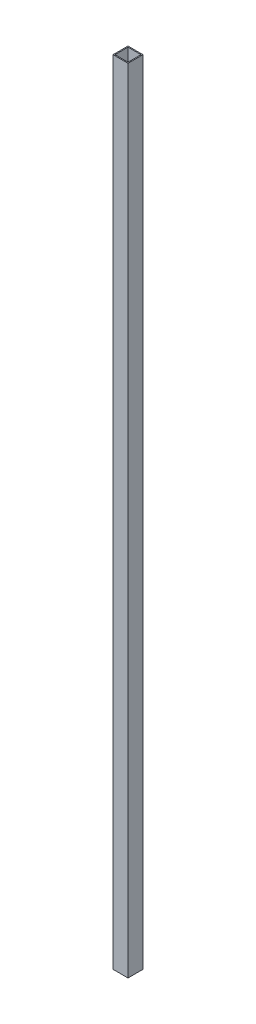
ISO-10303-21;
HEADER;
FILE_DESCRIPTION(('STEP AP214'),'2;1');
FILE_NAME('part.step','',(''),(''),'','','');
FILE_SCHEMA(('AUTOMOTIVE_DESIGN { 1 0 10303 214 1 1 1 1 }'));
ENDSEC;
DATA;
#1=APPLICATION_CONTEXT('core data for automotive mechanical design processes');
#2=APPLICATION_PROTOCOL_DEFINITION('international standard','automotive_design',2000,#1);
#3=PRODUCT_CONTEXT('',#1,'mechanical');
#4=PRODUCT('Part','Part','',(#3));
#5=PRODUCT_RELATED_PRODUCT_CATEGORY('part','',(#4));
#6=PRODUCT_DEFINITION_FORMATION('','',#4);
#7=PRODUCT_DEFINITION_CONTEXT('part definition',#1,'design');
#8=PRODUCT_DEFINITION('design','',#6,#7);
#9=PRODUCT_DEFINITION_SHAPE('','',#8);
#10=(LENGTH_UNIT() NAMED_UNIT(*) SI_UNIT(.MILLI.,.METRE.));
#11=(NAMED_UNIT(*) PLANE_ANGLE_UNIT() SI_UNIT($,.RADIAN.));
#12=(NAMED_UNIT(*) SI_UNIT($,.STERADIAN.) SOLID_ANGLE_UNIT());
#13=UNCERTAINTY_MEASURE_WITH_UNIT(LENGTH_MEASURE(1.E-05),#10,'distance_accuracy_value','');
#14=(GEOMETRIC_REPRESENTATION_CONTEXT(3) GLOBAL_UNCERTAINTY_ASSIGNED_CONTEXT((#13)) GLOBAL_UNIT_ASSIGNED_CONTEXT((#10,
#11,#12)) REPRESENTATION_CONTEXT('',''));
#15=CARTESIAN_POINT('',(0.,0.,0.));
#16=DIRECTION('',(0.,0.,1.));
#17=DIRECTION('',(1.,0.,0.));
#18=AXIS2_PLACEMENT_3D('',#15,#16,#17);
#19=CARTESIAN_POINT('',(0.,793.,0.));
#20=DIRECTION('',(0.,1.,0.));
#21=DIRECTION('',(0.,0.,1.));
#22=AXIS2_PLACEMENT_3D('',#19,#20,#21);
#23=PLANE('',#22);
#24=DIRECTION('',(0.,0.,-1.));
#25=VECTOR('',#24,1.);
#26=CARTESIAN_POINT('',(15.,793.,-15.));
#27=LINE('',#26,#25);
#28=CARTESIAN_POINT('',(15.,793.,15.));
#29=VERTEX_POINT('',#28);
#30=CARTESIAN_POINT('',(15.,793.,-15.));
#31=VERTEX_POINT('',#30);
#32=EDGE_CURVE('E153',#29,#31,#27,.T.);
#33=ORIENTED_EDGE('',*,*,#32,.T.);
#34=DIRECTION('',(-1.,0.,0.));
#35=VECTOR('',#34,1.);
#36=CARTESIAN_POINT('',(-15.,793.,-15.));
#37=LINE('',#36,#35);
#38=CARTESIAN_POINT('',(-15.,793.,-15.));
#39=VERTEX_POINT('',#38);
#40=EDGE_CURVE('E157',#31,#39,#37,.T.);
#41=ORIENTED_EDGE('',*,*,#40,.T.);
#42=DIRECTION('',(0.,0.,1.));
#43=VECTOR('',#42,1.);
#44=CARTESIAN_POINT('',(-15.,793.,-15.));
#45=LINE('',#44,#43);
#46=CARTESIAN_POINT('',(-15.,793.,15.));
#47=VERTEX_POINT('',#46);
#48=EDGE_CURVE('E161',#39,#47,#45,.T.);
#49=ORIENTED_EDGE('',*,*,#48,.T.);
#50=DIRECTION('',(1.,0.,0.));
#51=VECTOR('',#50,1.);
#52=CARTESIAN_POINT('',(-15.,793.,15.));
#53=LINE('',#52,#51);
#54=EDGE_CURVE('E164',#47,#29,#53,.T.);
#55=ORIENTED_EDGE('',*,*,#54,.T.);
#56=EDGE_LOOP('',(#33,#41,#49,#55));
#57=FACE_BOUND('',#56,.T.);
#58=DIRECTION('',(0.,0.,1.));
#59=VECTOR('',#58,1.);
#60=CARTESIAN_POINT('',(-13.,793.,-13.));
#61=LINE('',#60,#59);
#62=CARTESIAN_POINT('',(-13.,793.,-13.));
#63=VERTEX_POINT('',#62);
#64=CARTESIAN_POINT('',(-13.,793.,13.));
#65=VERTEX_POINT('',#64);
#66=EDGE_CURVE('E114',#63,#65,#61,.T.);
#67=ORIENTED_EDGE('',*,*,#66,.F.);
#68=DIRECTION('',(-1.,0.,0.));
#69=VECTOR('',#68,1.);
#70=CARTESIAN_POINT('',(-13.,793.,-13.));
#71=LINE('',#70,#69);
#72=CARTESIAN_POINT('',(13.,793.,-13.));
#73=VERTEX_POINT('',#72);
#74=EDGE_CURVE('E105',#73,#63,#71,.T.);
#75=ORIENTED_EDGE('',*,*,#74,.F.);
#76=DIRECTION('',(0.,0.,-1.));
#77=VECTOR('',#76,1.);
#78=CARTESIAN_POINT('',(13.,793.,-13.));
#79=LINE('',#78,#77);
#80=CARTESIAN_POINT('',(13.,793.,13.));
#81=VERTEX_POINT('',#80);
#82=EDGE_CURVE('E131',#81,#73,#79,.T.);
#83=ORIENTED_EDGE('',*,*,#82,.F.);
#84=DIRECTION('',(1.,0.,0.));
#85=VECTOR('',#84,1.);
#86=CARTESIAN_POINT('',(-13.,793.,13.));
#87=LINE('',#86,#85);
#88=EDGE_CURVE('E127',#65,#81,#87,.T.);
#89=ORIENTED_EDGE('',*,*,#88,.F.);
#90=EDGE_LOOP('',(#67,#75,#83,#89));
#91=FACE_BOUND('',#90,.T.);
#92=ADVANCED_FACE('F39',(#57,#91),#23,.T.);
#93=CARTESIAN_POINT('',(0.,-793.,0.));
#94=DIRECTION('',(0.,1.,0.));
#95=DIRECTION('',(0.,0.,1.));
#96=AXIS2_PLACEMENT_3D('',#93,#94,#95);
#97=PLANE('',#96);
#98=DIRECTION('',(0.,0.,-1.));
#99=VECTOR('',#98,1.);
#100=CARTESIAN_POINT('',(15.,-793.,-15.));
#101=LINE('',#100,#99);
#102=CARTESIAN_POINT('',(15.,-793.,15.));
#103=VERTEX_POINT('',#102);
#104=CARTESIAN_POINT('',(15.,-793.,-15.));
#105=VERTEX_POINT('',#104);
#106=EDGE_CURVE('E123',#103,#105,#101,.T.);
#107=ORIENTED_EDGE('',*,*,#106,.F.);
#108=DIRECTION('',(1.,0.,0.));
#109=VECTOR('',#108,1.);
#110=CARTESIAN_POINT('',(-15.,-793.,15.));
#111=LINE('',#110,#109);
#112=CARTESIAN_POINT('',(-15.,-793.,15.));
#113=VERTEX_POINT('',#112);
#114=EDGE_CURVE('E158',#113,#103,#111,.T.);
#115=ORIENTED_EDGE('',*,*,#114,.F.);
#116=DIRECTION('',(0.,0.,1.));
#117=VECTOR('',#116,1.);
#118=CARTESIAN_POINT('',(-15.,-793.,-15.));
#119=LINE('',#118,#117);
#120=CARTESIAN_POINT('',(-15.,-793.,-15.));
#121=VERTEX_POINT('',#120);
#122=EDGE_CURVE('E174',#121,#113,#119,.T.);
#123=ORIENTED_EDGE('',*,*,#122,.F.);
#124=DIRECTION('',(-1.,0.,0.));
#125=VECTOR('',#124,1.);
#126=CARTESIAN_POINT('',(-15.,-793.,-15.));
#127=LINE('',#126,#125);
#128=EDGE_CURVE('E171',#105,#121,#127,.T.);
#129=ORIENTED_EDGE('',*,*,#128,.F.);
#130=EDGE_LOOP('',(#107,#115,#123,#129));
#131=FACE_BOUND('',#130,.T.);
#132=DIRECTION('',(-1.,0.,0.));
#133=VECTOR('',#132,1.);
#134=CARTESIAN_POINT('',(-13.,-793.,-13.));
#135=LINE('',#134,#133);
#136=CARTESIAN_POINT('',(13.,-793.,-13.));
#137=VERTEX_POINT('',#136);
#138=CARTESIAN_POINT('',(-13.,-793.,-13.));
#139=VERTEX_POINT('',#138);
#140=EDGE_CURVE('E63',#137,#139,#135,.T.);
#141=ORIENTED_EDGE('',*,*,#140,.T.);
#142=DIRECTION('',(0.,0.,1.));
#143=VECTOR('',#142,1.);
#144=CARTESIAN_POINT('',(-13.,-793.,-13.));
#145=LINE('',#144,#143);
#146=CARTESIAN_POINT('',(-13.,-793.,13.));
#147=VERTEX_POINT('',#146);
#148=EDGE_CURVE('E121',#139,#147,#145,.T.);
#149=ORIENTED_EDGE('',*,*,#148,.T.);
#150=DIRECTION('',(1.,0.,0.));
#151=VECTOR('',#150,1.);
#152=CARTESIAN_POINT('',(-13.,-793.,13.));
#153=LINE('',#152,#151);
#154=CARTESIAN_POINT('',(13.,-793.,13.));
#155=VERTEX_POINT('',#154);
#156=EDGE_CURVE('E140',#147,#155,#153,.T.);
#157=ORIENTED_EDGE('',*,*,#156,.T.);
#158=DIRECTION('',(0.,0.,-1.));
#159=VECTOR('',#158,1.);
#160=CARTESIAN_POINT('',(13.,-793.,-13.));
#161=LINE('',#160,#159);
#162=EDGE_CURVE('E115',#155,#137,#161,.T.);
#163=ORIENTED_EDGE('',*,*,#162,.T.);
#164=EDGE_LOOP('',(#141,#149,#157,#163));
#165=FACE_BOUND('',#164,.T.);
#166=ADVANCED_FACE('F197',(#131,#165),#97,.F.);
#167=CARTESIAN_POINT('',(15.,793.,-15.));
#168=DIRECTION('',(-1.,0.,0.));
#169=DIRECTION('',(0.,0.,1.));
#170=AXIS2_PLACEMENT_3D('',#167,#168,#169);
#171=PLANE('',#170);
#172=ORIENTED_EDGE('',*,*,#106,.T.);
#173=DIRECTION('',(0.,-1.,0.));
#174=VECTOR('',#173,1.);
#175=CARTESIAN_POINT('',(15.,793.,-15.));
#176=LINE('',#175,#174);
#177=EDGE_CURVE('E11',#31,#105,#176,.T.);
#178=ORIENTED_EDGE('',*,*,#177,.F.);
#179=ORIENTED_EDGE('',*,*,#32,.F.);
#180=DIRECTION('',(0.,-1.,0.));
#181=VECTOR('',#180,1.);
#182=CARTESIAN_POINT('',(15.,793.,15.));
#183=LINE('',#182,#181);
#184=EDGE_CURVE('E167',#29,#103,#183,.T.);
#185=ORIENTED_EDGE('',*,*,#184,.T.);
#186=EDGE_LOOP('',(#172,#178,#179,#185));
#187=FACE_BOUND('',#186,.T.);
#188=ADVANCED_FACE('F41',(#187),#171,.F.);
#189=CARTESIAN_POINT('',(-15.,793.,-15.));
#190=DIRECTION('',(0.,0.,1.));
#191=DIRECTION('',(1.,0.,0.));
#192=AXIS2_PLACEMENT_3D('',#189,#190,#191);
#193=PLANE('',#192);
#194=ORIENTED_EDGE('',*,*,#128,.T.);
#195=DIRECTION('',(0.,-1.,0.));
#196=VECTOR('',#195,1.);
#197=CARTESIAN_POINT('',(-15.,793.,-15.));
#198=LINE('',#197,#196);
#199=EDGE_CURVE('E48',#39,#121,#198,.T.);
#200=ORIENTED_EDGE('',*,*,#199,.F.);
#201=ORIENTED_EDGE('',*,*,#40,.F.);
#202=ORIENTED_EDGE('',*,*,#177,.T.);
#203=EDGE_LOOP('',(#194,#200,#201,#202));
#204=FACE_BOUND('',#203,.T.);
#205=ADVANCED_FACE('F207',(#204),#193,.F.);
#206=CARTESIAN_POINT('',(-15.,793.,-15.));
#207=DIRECTION('',(1.,0.,0.));
#208=DIRECTION('',(0.,0.,-1.));
#209=AXIS2_PLACEMENT_3D('',#206,#207,#208);
#210=PLANE('',#209);
#211=ORIENTED_EDGE('',*,*,#122,.T.);
#212=DIRECTION('',(0.,-1.,0.));
#213=VECTOR('',#212,1.);
#214=CARTESIAN_POINT('',(-15.,793.,15.));
#215=LINE('',#214,#213);
#216=EDGE_CURVE('E182',#47,#113,#215,.T.);
#217=ORIENTED_EDGE('',*,*,#216,.F.);
#218=ORIENTED_EDGE('',*,*,#48,.F.);
#219=ORIENTED_EDGE('',*,*,#199,.T.);
#220=EDGE_LOOP('',(#211,#217,#218,#219));
#221=FACE_BOUND('',#220,.T.);
#222=ADVANCED_FACE('F191',(#221),#210,.F.);
#223=CARTESIAN_POINT('',(-15.,793.,15.));
#224=DIRECTION('',(0.,0.,-1.));
#225=DIRECTION('',(-1.,0.,0.));
#226=AXIS2_PLACEMENT_3D('',#223,#224,#225);
#227=PLANE('',#226);
#228=ORIENTED_EDGE('',*,*,#114,.T.);
#229=ORIENTED_EDGE('',*,*,#184,.F.);
#230=ORIENTED_EDGE('',*,*,#54,.F.);
#231=ORIENTED_EDGE('',*,*,#216,.T.);
#232=EDGE_LOOP('',(#228,#229,#230,#231));
#233=FACE_BOUND('',#232,.T.);
#234=ADVANCED_FACE('F201',(#233),#227,.F.);
#235=CARTESIAN_POINT('',(-13.,793.,-13.));
#236=DIRECTION('',(0.,0.,1.));
#237=DIRECTION('',(1.,0.,0.));
#238=AXIS2_PLACEMENT_3D('',#235,#236,#237);
#239=PLANE('',#238);
#240=ORIENTED_EDGE('',*,*,#140,.F.);
#241=DIRECTION('',(0.,-1.,0.));
#242=VECTOR('',#241,1.);
#243=CARTESIAN_POINT('',(13.,793.,-13.));
#244=LINE('',#243,#242);
#245=EDGE_CURVE('E109',#73,#137,#244,.T.);
#246=ORIENTED_EDGE('',*,*,#245,.F.);
#247=ORIENTED_EDGE('',*,*,#74,.T.);
#248=DIRECTION('',(0.,-1.,0.));
#249=VECTOR('',#248,1.);
#250=CARTESIAN_POINT('',(-13.,793.,-13.));
#251=LINE('',#250,#249);
#252=EDGE_CURVE('E108',#63,#139,#251,.T.);
#253=ORIENTED_EDGE('',*,*,#252,.T.);
#254=EDGE_LOOP('',(#240,#246,#247,#253));
#255=FACE_BOUND('',#254,.T.);
#256=ADVANCED_FACE('F107',(#255),#239,.T.);
#257=CARTESIAN_POINT('',(-13.,793.,-13.));
#258=DIRECTION('',(1.,0.,0.));
#259=DIRECTION('',(0.,0.,-1.));
#260=AXIS2_PLACEMENT_3D('',#257,#258,#259);
#261=PLANE('',#260);
#262=ORIENTED_EDGE('',*,*,#148,.F.);
#263=ORIENTED_EDGE('',*,*,#252,.F.);
#264=ORIENTED_EDGE('',*,*,#66,.T.);
#265=DIRECTION('',(0.,-1.,0.));
#266=VECTOR('',#265,1.);
#267=CARTESIAN_POINT('',(-13.,793.,13.));
#268=LINE('',#267,#266);
#269=EDGE_CURVE('E124',#65,#147,#268,.T.);
#270=ORIENTED_EDGE('',*,*,#269,.T.);
#271=EDGE_LOOP('',(#262,#263,#264,#270));
#272=FACE_BOUND('',#271,.T.);
#273=ADVANCED_FACE('F118',(#272),#261,.T.);
#274=CARTESIAN_POINT('',(-13.,793.,13.));
#275=DIRECTION('',(0.,0.,-1.));
#276=DIRECTION('',(-1.,0.,0.));
#277=AXIS2_PLACEMENT_3D('',#274,#275,#276);
#278=PLANE('',#277);
#279=ORIENTED_EDGE('',*,*,#156,.F.);
#280=ORIENTED_EDGE('',*,*,#269,.F.);
#281=ORIENTED_EDGE('',*,*,#88,.T.);
#282=DIRECTION('',(0.,-1.,0.));
#283=VECTOR('',#282,1.);
#284=CARTESIAN_POINT('',(13.,793.,13.));
#285=LINE('',#284,#283);
#286=EDGE_CURVE('E55',#81,#155,#285,.T.);
#287=ORIENTED_EDGE('',*,*,#286,.T.);
#288=EDGE_LOOP('',(#279,#280,#281,#287));
#289=FACE_BOUND('',#288,.T.);
#290=ADVANCED_FACE('F230',(#289),#278,.T.);
#291=CARTESIAN_POINT('',(13.,793.,-13.));
#292=DIRECTION('',(-1.,0.,0.));
#293=DIRECTION('',(0.,0.,1.));
#294=AXIS2_PLACEMENT_3D('',#291,#292,#293);
#295=PLANE('',#294);
#296=ORIENTED_EDGE('',*,*,#162,.F.);
#297=ORIENTED_EDGE('',*,*,#286,.F.);
#298=ORIENTED_EDGE('',*,*,#82,.T.);
#299=ORIENTED_EDGE('',*,*,#245,.T.);
#300=EDGE_LOOP('',(#296,#297,#298,#299));
#301=FACE_BOUND('',#300,.T.);
#302=ADVANCED_FACE('F234',(#301),#295,.T.);
#303=CLOSED_SHELL('',(#92,#166,#188,#205,#222,#234,#256,#273,#290,#302));
#304=MANIFOLD_SOLID_BREP('B2',#303);
#305=ADVANCED_BREP_SHAPE_REPRESENTATION('',(#18,#304),#14);
#306=SHAPE_DEFINITION_REPRESENTATION(#9,#305);
ENDSEC;
END-ISO-10303-21;
